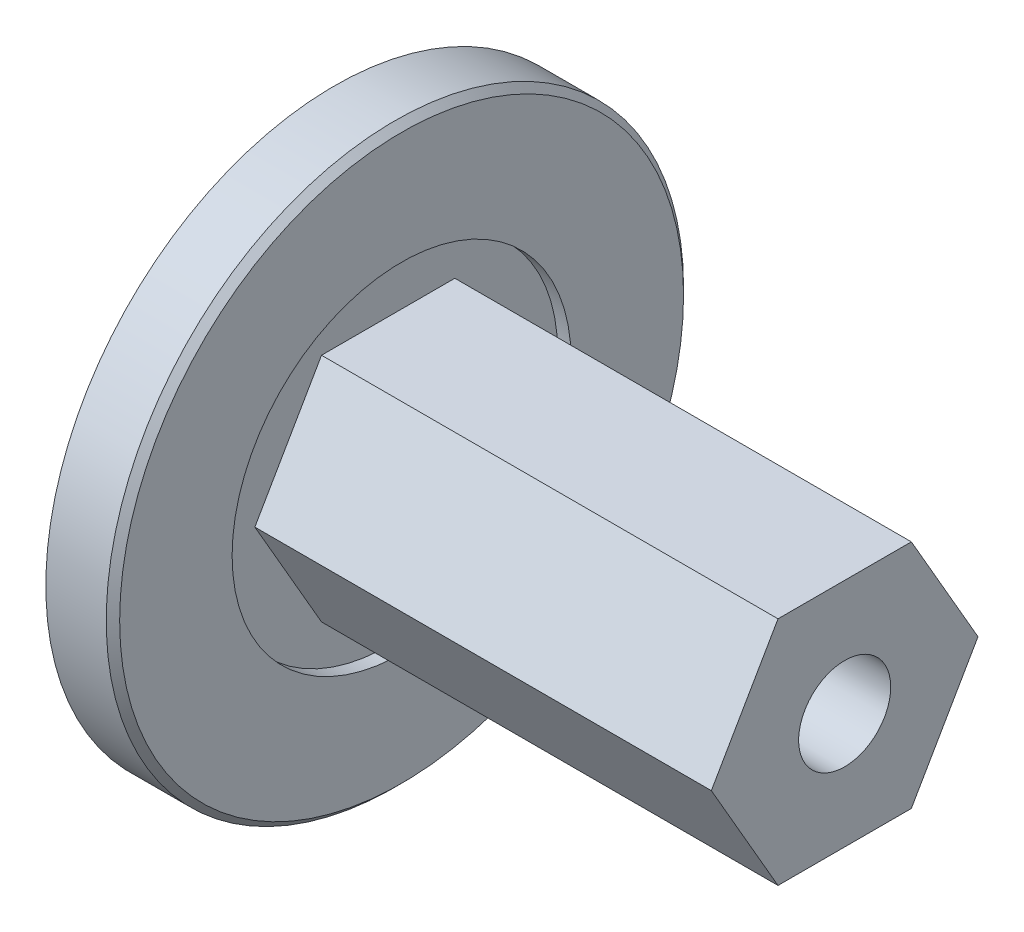
ISO-10303-21;
HEADER;
FILE_DESCRIPTION(('STEP AP214'),'2;1');
FILE_NAME('part.step','',(''),(''),'','','');
FILE_SCHEMA(('AUTOMOTIVE_DESIGN { 1 0 10303 214 1 1 1 1 }'));
ENDSEC;
DATA;
#1=APPLICATION_CONTEXT('core data for automotive mechanical design processes');
#2=APPLICATION_PROTOCOL_DEFINITION('international standard','automotive_design',2000,#1);
#3=PRODUCT_CONTEXT('',#1,'mechanical');
#4=PRODUCT('Part','Part','',(#3));
#5=PRODUCT_RELATED_PRODUCT_CATEGORY('part','',(#4));
#6=PRODUCT_DEFINITION_FORMATION('','',#4);
#7=PRODUCT_DEFINITION_CONTEXT('part definition',#1,'design');
#8=PRODUCT_DEFINITION('design','',#6,#7);
#9=PRODUCT_DEFINITION_SHAPE('','',#8);
#10=(LENGTH_UNIT() NAMED_UNIT(*) SI_UNIT(.MILLI.,.METRE.));
#11=(NAMED_UNIT(*) PLANE_ANGLE_UNIT() SI_UNIT($,.RADIAN.));
#12=(NAMED_UNIT(*) SI_UNIT($,.STERADIAN.) SOLID_ANGLE_UNIT());
#13=UNCERTAINTY_MEASURE_WITH_UNIT(LENGTH_MEASURE(1.E-05),#10,'distance_accuracy_value','');
#14=(GEOMETRIC_REPRESENTATION_CONTEXT(3) GLOBAL_UNCERTAINTY_ASSIGNED_CONTEXT((#13)) GLOBAL_UNIT_ASSIGNED_CONTEXT((#10,
#11,#12)) REPRESENTATION_CONTEXT('',''));
#15=CARTESIAN_POINT('',(0.,0.,0.));
#16=DIRECTION('',(0.,0.,1.));
#17=DIRECTION('',(1.,0.,0.));
#18=AXIS2_PLACEMENT_3D('',#15,#16,#17);
#19=CARTESIAN_POINT('',(4.,0.,0.));
#20=DIRECTION('',(1.,0.,0.));
#21=DIRECTION('',(0.,0.,-1.));
#22=AXIS2_PLACEMENT_3D('',#19,#20,#21);
#23=PLANE('',#22);
#24=CARTESIAN_POINT('',(4.,0.,0.));
#25=DIRECTION('',(1.,0.,0.));
#26=DIRECTION('',(0.,0.,-1.));
#27=AXIS2_PLACEMENT_3D('',#24,#25,#26);
#28=CIRCLE('',#27,12.625);
#29=CARTESIAN_POINT('',(4.,0.,-12.625));
#30=VERTEX_POINT('',#29);
#31=EDGE_CURVE('E159',#30,#30,#28,.F.);
#32=ORIENTED_EDGE('',*,*,#31,.F.);
#33=EDGE_LOOP('',(#32));
#34=FACE_BOUND('',#33,.T.);
#35=DIRECTION('',(0.,0.866025403784439,-0.5));
#36=VECTOR('',#35,1.);
#37=CARTESIAN_POINT('',(4.,-8.6,-4.96521231503078));
#38=LINE('',#37,#36);
#39=CARTESIAN_POINT('',(4.,-8.6,-4.96521231503078));
#40=VERTEX_POINT('',#39);
#41=CARTESIAN_POINT('',(4.,0.,-9.93042463006156));
#42=VERTEX_POINT('',#41);
#43=EDGE_CURVE('E132',#40,#42,#38,.T.);
#44=ORIENTED_EDGE('',*,*,#43,.F.);
#45=DIRECTION('',(0.,0.,-1.));
#46=VECTOR('',#45,1.);
#47=CARTESIAN_POINT('',(4.,-8.6,4.96521231503078));
#48=LINE('',#47,#46);
#49=CARTESIAN_POINT('',(4.,-8.6,4.96521231503078));
#50=VERTEX_POINT('',#49);
#51=EDGE_CURVE('E129',#50,#40,#48,.T.);
#52=ORIENTED_EDGE('',*,*,#51,.F.);
#53=DIRECTION('',(0.,-0.866025403784439,-0.5));
#54=VECTOR('',#53,1.);
#55=CARTESIAN_POINT('',(4.,0.,9.93042463006156));
#56=LINE('',#55,#54);
#57=CARTESIAN_POINT('',(4.,0.,9.93042463006156));
#58=VERTEX_POINT('',#57);
#59=EDGE_CURVE('E87',#58,#50,#56,.T.);
#60=ORIENTED_EDGE('',*,*,#59,.F.);
#61=DIRECTION('',(0.,-0.866025403784438,0.5));
#62=VECTOR('',#61,1.);
#63=CARTESIAN_POINT('',(4.,8.6,4.96521231503078));
#64=LINE('',#63,#62);
#65=CARTESIAN_POINT('',(4.,8.6,4.96521231503078));
#66=VERTEX_POINT('',#65);
#67=EDGE_CURVE('E138',#66,#58,#64,.T.);
#68=ORIENTED_EDGE('',*,*,#67,.F.);
#69=DIRECTION('',(0.,0.,1.));
#70=VECTOR('',#69,1.);
#71=CARTESIAN_POINT('',(4.,8.6,-4.96521231503078));
#72=LINE('',#71,#70);
#73=CARTESIAN_POINT('',(4.,8.6,-4.96521231503078));
#74=VERTEX_POINT('',#73);
#75=EDGE_CURVE('E118',#74,#66,#72,.T.);
#76=ORIENTED_EDGE('',*,*,#75,.F.);
#77=DIRECTION('',(0.,0.866025403784439,0.5));
#78=VECTOR('',#77,1.);
#79=CARTESIAN_POINT('',(4.,0.,-9.93042463006156));
#80=LINE('',#79,#78);
#81=EDGE_CURVE('E135',#42,#74,#80,.T.);
#82=ORIENTED_EDGE('',*,*,#81,.F.);
#83=EDGE_LOOP('',(#44,#52,#60,#68,#76,#82));
#84=FACE_BOUND('',#83,.T.);
#85=ADVANCED_FACE('F43',(#34,#84),#23,.T.);
#86=CARTESIAN_POINT('',(4.,0.,0.));
#87=DIRECTION('',(-1.,0.,0.));
#88=DIRECTION('',(0.,0.,1.));
#89=AXIS2_PLACEMENT_3D('',#86,#87,#88);
#90=CYLINDRICAL_SURFACE('',#89,21.5);
#91=CARTESIAN_POINT('',(4.50000000000003,0.,0.));
#92=DIRECTION('',(1.,0.,0.));
#93=DIRECTION('',(0.,0.,-1.));
#94=AXIS2_PLACEMENT_3D('',#91,#92,#93);
#95=CIRCLE('',#94,21.5);
#96=CARTESIAN_POINT('',(4.50000000000003,0.,-21.5));
#97=VERTEX_POINT('',#96);
#98=EDGE_CURVE('E11',#97,#97,#95,.F.);
#99=ORIENTED_EDGE('',*,*,#98,.T.);
#100=EDGE_LOOP('',(#99));
#101=FACE_BOUND('',#100,.T.);
#102=CARTESIAN_POINT('',(0.,0.,0.));
#103=DIRECTION('',(1.,0.,0.));
#104=DIRECTION('',(0.,0.,-1.));
#105=AXIS2_PLACEMENT_3D('',#102,#103,#104);
#106=CIRCLE('',#105,21.5);
#107=CARTESIAN_POINT('',(0.,0.,-21.5));
#108=VERTEX_POINT('',#107);
#109=EDGE_CURVE('E156',#108,#108,#106,.T.);
#110=ORIENTED_EDGE('',*,*,#109,.T.);
#111=EDGE_LOOP('',(#110));
#112=FACE_BOUND('',#111,.T.);
#113=ADVANCED_FACE('F177',(#101,#112),#90,.T.);
#114=CARTESIAN_POINT('',(0.,0.,0.));
#115=DIRECTION('',(1.,0.,0.));
#116=DIRECTION('',(0.,0.,-1.));
#117=AXIS2_PLACEMENT_3D('',#114,#115,#116);
#118=PLANE('',#117);
#119=CARTESIAN_POINT('',(0.,0.,0.));
#120=DIRECTION('',(1.,0.,0.));
#121=DIRECTION('',(0.,0.,-1.));
#122=AXIS2_PLACEMENT_3D('',#119,#120,#121);
#123=CIRCLE('',#122,3.429);
#124=CARTESIAN_POINT('',(0.,0.,-3.429));
#125=VERTEX_POINT('',#124);
#126=EDGE_CURVE('E150',#125,#125,#123,.T.);
#127=ORIENTED_EDGE('',*,*,#126,.T.);
#128=EDGE_LOOP('',(#127));
#129=FACE_BOUND('',#128,.T.);
#130=ORIENTED_EDGE('',*,*,#109,.F.);
#131=EDGE_LOOP('',(#130));
#132=FACE_BOUND('',#131,.T.);
#133=ADVANCED_FACE('F185',(#129,#132),#118,.F.);
#134=CARTESIAN_POINT('',(5.,0.,0.));
#135=DIRECTION('',(1.,0.,0.));
#136=DIRECTION('',(0.,0.,-1.));
#137=AXIS2_PLACEMENT_3D('',#134,#135,#136);
#138=PLANE('',#137);
#139=CARTESIAN_POINT('',(5.,0.,0.));
#140=DIRECTION('',(1.,0.,0.));
#141=DIRECTION('',(0.,0.,-1.));
#142=AXIS2_PLACEMENT_3D('',#139,#140,#141);
#143=CIRCLE('',#142,21.);
#144=CARTESIAN_POINT('',(5.,0.,-21.));
#145=VERTEX_POINT('',#144);
#146=EDGE_CURVE('E52',#145,#145,#143,.T.);
#147=ORIENTED_EDGE('',*,*,#146,.T.);
#148=EDGE_LOOP('',(#147));
#149=FACE_BOUND('',#148,.T.);
#150=CARTESIAN_POINT('',(5.,0.,0.));
#151=DIRECTION('',(1.,0.,0.));
#152=DIRECTION('',(0.,0.,-1.));
#153=AXIS2_PLACEMENT_3D('',#150,#151,#152);
#154=CIRCLE('',#153,12.625);
#155=CARTESIAN_POINT('',(5.,0.,-12.625));
#156=VERTEX_POINT('',#155);
#157=EDGE_CURVE('E153',#156,#156,#154,.T.);
#158=ORIENTED_EDGE('',*,*,#157,.F.);
#159=EDGE_LOOP('',(#158));
#160=FACE_BOUND('',#159,.T.);
#161=ADVANCED_FACE('F164',(#149,#160),#138,.T.);
#162=CARTESIAN_POINT('',(5.,0.,0.));
#163=DIRECTION('',(-1.,0.,0.));
#164=DIRECTION('',(0.,0.,1.));
#165=AXIS2_PLACEMENT_3D('',#162,#163,#164);
#166=CYLINDRICAL_SURFACE('',#165,12.625);
#167=ORIENTED_EDGE('',*,*,#157,.T.);
#168=EDGE_LOOP('',(#167));
#169=FACE_BOUND('',#168,.T.);
#170=ORIENTED_EDGE('',*,*,#31,.T.);
#171=EDGE_LOOP('',(#170));
#172=FACE_BOUND('',#171,.T.);
#173=ADVANCED_FACE('F196',(#169,#172),#166,.F.);
#174=CARTESIAN_POINT('',(5.,0.,0.));
#175=DIRECTION('',(-1.,0.,0.));
#176=DIRECTION('',(0.,0.,1.));
#177=AXIS2_PLACEMENT_3D('',#174,#175,#176);
#178=CYLINDRICAL_SURFACE('',#177,3.429);
#179=ORIENTED_EDGE('',*,*,#126,.F.);
#180=EDGE_LOOP('',(#179));
#181=FACE_BOUND('',#180,.T.);
#182=CARTESIAN_POINT('',(38.,0.,0.));
#183=DIRECTION('',(1.,0.,0.));
#184=DIRECTION('',(0.,0.,-1.));
#185=AXIS2_PLACEMENT_3D('',#182,#183,#184);
#186=CIRCLE('',#185,3.429);
#187=CARTESIAN_POINT('',(38.,0.,-3.429));
#188=VERTEX_POINT('',#187);
#189=EDGE_CURVE('E133',#188,#188,#186,.T.);
#190=ORIENTED_EDGE('',*,*,#189,.T.);
#191=EDGE_LOOP('',(#190));
#192=FACE_BOUND('',#191,.T.);
#193=ADVANCED_FACE('F202',(#181,#192),#178,.F.);
#194=CARTESIAN_POINT('',(38.,0.,0.));
#195=DIRECTION('',(1.,0.,0.));
#196=DIRECTION('',(0.,0.,-1.));
#197=AXIS2_PLACEMENT_3D('',#194,#195,#196);
#198=PLANE('',#197);
#199=DIRECTION('',(0.,0.,-1.));
#200=VECTOR('',#199,1.);
#201=CARTESIAN_POINT('',(38.,-8.6,4.96521231503078));
#202=LINE('',#201,#200);
#203=CARTESIAN_POINT('',(38.,-8.6,4.96521231503078));
#204=VERTEX_POINT('',#203);
#205=CARTESIAN_POINT('',(38.,-8.6,-4.96521231503078));
#206=VERTEX_POINT('',#205);
#207=EDGE_CURVE('E141',#204,#206,#202,.T.);
#208=ORIENTED_EDGE('',*,*,#207,.T.);
#209=DIRECTION('',(0.,0.866025403784439,-0.5));
#210=VECTOR('',#209,1.);
#211=CARTESIAN_POINT('',(38.,-8.6,-4.96521231503078));
#212=LINE('',#211,#210);
#213=CARTESIAN_POINT('',(38.,0.,-9.93042463006156));
#214=VERTEX_POINT('',#213);
#215=EDGE_CURVE('E95',#206,#214,#212,.T.);
#216=ORIENTED_EDGE('',*,*,#215,.T.);
#217=DIRECTION('',(0.,0.866025403784439,0.5));
#218=VECTOR('',#217,1.);
#219=CARTESIAN_POINT('',(38.,0.,-9.93042463006156));
#220=LINE('',#219,#218);
#221=CARTESIAN_POINT('',(38.,8.6,-4.96521231503078));
#222=VERTEX_POINT('',#221);
#223=EDGE_CURVE('E109',#214,#222,#220,.T.);
#224=ORIENTED_EDGE('',*,*,#223,.T.);
#225=DIRECTION('',(0.,0.,1.));
#226=VECTOR('',#225,1.);
#227=CARTESIAN_POINT('',(38.,8.6,-4.96521231503078));
#228=LINE('',#227,#226);
#229=CARTESIAN_POINT('',(38.,8.6,4.96521231503078));
#230=VERTEX_POINT('',#229);
#231=EDGE_CURVE('E102',#222,#230,#228,.T.);
#232=ORIENTED_EDGE('',*,*,#231,.T.);
#233=DIRECTION('',(0.,-0.866025403784438,0.5));
#234=VECTOR('',#233,1.);
#235=CARTESIAN_POINT('',(38.,8.6,4.96521231503078));
#236=LINE('',#235,#234);
#237=CARTESIAN_POINT('',(38.,0.,9.93042463006156));
#238=VERTEX_POINT('',#237);
#239=EDGE_CURVE('E107',#230,#238,#236,.T.);
#240=ORIENTED_EDGE('',*,*,#239,.T.);
#241=DIRECTION('',(0.,-0.866025403784439,-0.5));
#242=VECTOR('',#241,1.);
#243=CARTESIAN_POINT('',(38.,0.,9.93042463006156));
#244=LINE('',#243,#242);
#245=EDGE_CURVE('E67',#238,#204,#244,.T.);
#246=ORIENTED_EDGE('',*,*,#245,.T.);
#247=EDGE_LOOP('',(#208,#216,#224,#232,#240,#246));
#248=FACE_BOUND('',#247,.T.);
#249=ORIENTED_EDGE('',*,*,#189,.F.);
#250=EDGE_LOOP('',(#249));
#251=FACE_BOUND('',#250,.T.);
#252=ADVANCED_FACE('F104',(#248,#251),#198,.T.);
#253=CARTESIAN_POINT('',(38.,-8.6,4.96521231503078));
#254=DIRECTION('',(0.,1.,0.));
#255=DIRECTION('',(0.,0.,1.));
#256=AXIS2_PLACEMENT_3D('',#253,#254,#255);
#257=PLANE('',#256);
#258=ORIENTED_EDGE('',*,*,#51,.T.);
#259=DIRECTION('',(-1.,0.,0.));
#260=VECTOR('',#259,1.);
#261=CARTESIAN_POINT('',(38.,-8.6,-4.96521231503078));
#262=LINE('',#261,#260);
#263=EDGE_CURVE('E148',#206,#40,#262,.T.);
#264=ORIENTED_EDGE('',*,*,#263,.F.);
#265=ORIENTED_EDGE('',*,*,#207,.F.);
#266=DIRECTION('',(-1.,0.,0.));
#267=VECTOR('',#266,1.);
#268=CARTESIAN_POINT('',(38.,-8.6,4.96521231503078));
#269=LINE('',#268,#267);
#270=EDGE_CURVE('E125',#204,#50,#269,.T.);
#271=ORIENTED_EDGE('',*,*,#270,.T.);
#272=EDGE_LOOP('',(#258,#264,#265,#271));
#273=FACE_BOUND('',#272,.T.);
#274=ADVANCED_FACE('F219',(#273),#257,.F.);
#275=CARTESIAN_POINT('',(38.,-8.6,-4.96521231503078));
#276=DIRECTION('',(0.,0.5,0.866025403784439));
#277=DIRECTION('',(0.,-0.866025403784439,0.5));
#278=AXIS2_PLACEMENT_3D('',#275,#276,#277);
#279=PLANE('',#278);
#280=ORIENTED_EDGE('',*,*,#43,.T.);
#281=DIRECTION('',(-1.,0.,0.));
#282=VECTOR('',#281,1.);
#283=CARTESIAN_POINT('',(38.,0.,-9.93042463006156));
#284=LINE('',#283,#282);
#285=EDGE_CURVE('E145',#214,#42,#284,.T.);
#286=ORIENTED_EDGE('',*,*,#285,.F.);
#287=ORIENTED_EDGE('',*,*,#215,.F.);
#288=ORIENTED_EDGE('',*,*,#263,.T.);
#289=EDGE_LOOP('',(#280,#286,#287,#288));
#290=FACE_BOUND('',#289,.T.);
#291=ADVANCED_FACE('F212',(#290),#279,.F.);
#292=CARTESIAN_POINT('',(38.,0.,-9.93042463006156));
#293=DIRECTION('',(0.,-0.5,0.866025403784439));
#294=DIRECTION('',(0.,-0.866025403784439,-0.5));
#295=AXIS2_PLACEMENT_3D('',#292,#293,#294);
#296=PLANE('',#295);
#297=ORIENTED_EDGE('',*,*,#81,.T.);
#298=DIRECTION('',(-1.,0.,0.));
#299=VECTOR('',#298,1.);
#300=CARTESIAN_POINT('',(38.,8.6,-4.96521231503078));
#301=LINE('',#300,#299);
#302=EDGE_CURVE('E121',#222,#74,#301,.T.);
#303=ORIENTED_EDGE('',*,*,#302,.F.);
#304=ORIENTED_EDGE('',*,*,#223,.F.);
#305=ORIENTED_EDGE('',*,*,#285,.T.);
#306=EDGE_LOOP('',(#297,#303,#304,#305));
#307=FACE_BOUND('',#306,.T.);
#308=ADVANCED_FACE('F216',(#307),#296,.F.);
#309=CARTESIAN_POINT('',(38.,8.6,-4.96521231503078));
#310=DIRECTION('',(0.,-1.,0.));
#311=DIRECTION('',(0.,0.,-1.));
#312=AXIS2_PLACEMENT_3D('',#309,#310,#311);
#313=PLANE('',#312);
#314=ORIENTED_EDGE('',*,*,#75,.T.);
#315=DIRECTION('',(-1.,0.,0.));
#316=VECTOR('',#315,1.);
#317=CARTESIAN_POINT('',(38.,8.6,4.96521231503078));
#318=LINE('',#317,#316);
#319=EDGE_CURVE('E115',#230,#66,#318,.T.);
#320=ORIENTED_EDGE('',*,*,#319,.F.);
#321=ORIENTED_EDGE('',*,*,#231,.F.);
#322=ORIENTED_EDGE('',*,*,#302,.T.);
#323=EDGE_LOOP('',(#314,#320,#321,#322));
#324=FACE_BOUND('',#323,.T.);
#325=ADVANCED_FACE('F116',(#324),#313,.F.);
#326=CARTESIAN_POINT('',(38.,8.6,4.96521231503078));
#327=DIRECTION('',(0.,-0.5,-0.866025403784439));
#328=DIRECTION('',(0.,0.866025403784438,-0.5));
#329=AXIS2_PLACEMENT_3D('',#326,#327,#328);
#330=PLANE('',#329);
#331=ORIENTED_EDGE('',*,*,#67,.T.);
#332=DIRECTION('',(-1.,0.,0.));
#333=VECTOR('',#332,1.);
#334=CARTESIAN_POINT('',(38.,0.,9.93042463006156));
#335=LINE('',#334,#333);
#336=EDGE_CURVE('E59',#238,#58,#335,.T.);
#337=ORIENTED_EDGE('',*,*,#336,.F.);
#338=ORIENTED_EDGE('',*,*,#239,.F.);
#339=ORIENTED_EDGE('',*,*,#319,.T.);
#340=EDGE_LOOP('',(#331,#337,#338,#339));
#341=FACE_BOUND('',#340,.T.);
#342=ADVANCED_FACE('F123',(#341),#330,.F.);
#343=CARTESIAN_POINT('',(38.,0.,9.93042463006156));
#344=DIRECTION('',(0.,0.5,-0.866025403784439));
#345=DIRECTION('',(0.,0.866025403784439,0.5));
#346=AXIS2_PLACEMENT_3D('',#343,#344,#345);
#347=PLANE('',#346);
#348=ORIENTED_EDGE('',*,*,#59,.T.);
#349=ORIENTED_EDGE('',*,*,#270,.F.);
#350=ORIENTED_EDGE('',*,*,#245,.F.);
#351=ORIENTED_EDGE('',*,*,#336,.T.);
#352=EDGE_LOOP('',(#348,#349,#350,#351));
#353=FACE_BOUND('',#352,.T.);
#354=ADVANCED_FACE('F168',(#353),#347,.F.);
#355=CARTESIAN_POINT('',(5.,0.,0.));
#356=DIRECTION('',(-1.,0.,0.));
#357=DIRECTION('',(0.,0.,1.));
#358=AXIS2_PLACEMENT_3D('',#355,#356,#357);
#359=CONICAL_SURFACE('',#358,21.,0.785398163397448);
#360=ORIENTED_EDGE('',*,*,#98,.F.);
#361=EDGE_LOOP('',(#360));
#362=FACE_BOUND('',#361,.T.);
#363=ORIENTED_EDGE('',*,*,#146,.F.);
#364=EDGE_LOOP('',(#363));
#365=FACE_BOUND('',#364,.T.);
#366=ADVANCED_FACE('F46',(#362,#365),#359,.T.);
#367=CLOSED_SHELL('',(#85,#113,#133,#161,#173,#193,#252,#274,#291,#308,#325,#342,#354,#366));
#368=MANIFOLD_SOLID_BREP('B2',#367);
#369=ADVANCED_BREP_SHAPE_REPRESENTATION('',(#18,#368),#14);
#370=SHAPE_DEFINITION_REPRESENTATION(#9,#369);
ENDSEC;
END-ISO-10303-21;
